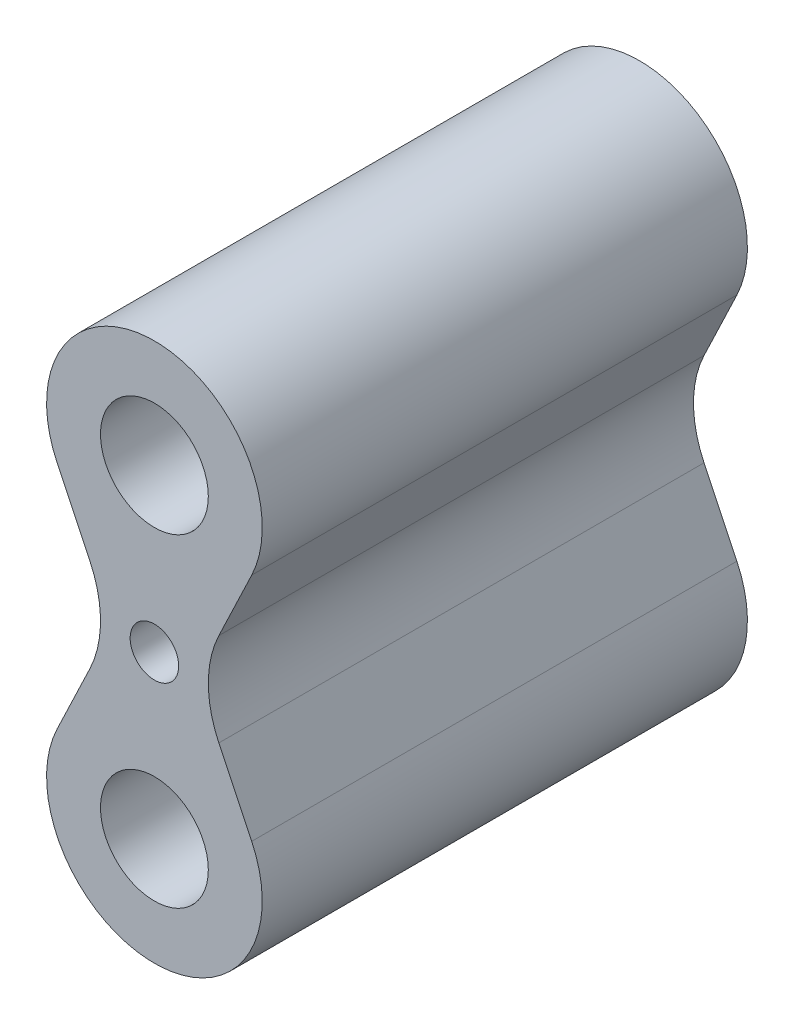
ISO-10303-21;
HEADER;
FILE_DESCRIPTION(('STEP AP214'),'2;1');
FILE_NAME('part.step','',(''),(''),'','','');
FILE_SCHEMA(('AUTOMOTIVE_DESIGN { 1 0 10303 214 1 1 1 1 }'));
ENDSEC;
DATA;
#1=APPLICATION_CONTEXT('core data for automotive mechanical design processes');
#2=APPLICATION_PROTOCOL_DEFINITION('international standard','automotive_design',2000,#1);
#3=PRODUCT_CONTEXT('',#1,'mechanical');
#4=PRODUCT('Part','Part','',(#3));
#5=PRODUCT_RELATED_PRODUCT_CATEGORY('part','',(#4));
#6=PRODUCT_DEFINITION_FORMATION('','',#4);
#7=PRODUCT_DEFINITION_CONTEXT('part definition',#1,'design');
#8=PRODUCT_DEFINITION('design','',#6,#7);
#9=PRODUCT_DEFINITION_SHAPE('','',#8);
#10=(LENGTH_UNIT() NAMED_UNIT(*) SI_UNIT(.MILLI.,.METRE.));
#11=(NAMED_UNIT(*) PLANE_ANGLE_UNIT() SI_UNIT($,.RADIAN.));
#12=(NAMED_UNIT(*) SI_UNIT($,.STERADIAN.) SOLID_ANGLE_UNIT());
#13=UNCERTAINTY_MEASURE_WITH_UNIT(LENGTH_MEASURE(1.E-05),#10,'distance_accuracy_value','');
#14=(GEOMETRIC_REPRESENTATION_CONTEXT(3) GLOBAL_UNCERTAINTY_ASSIGNED_CONTEXT((#13)) GLOBAL_UNIT_ASSIGNED_CONTEXT((#10,
#11,#12)) REPRESENTATION_CONTEXT('',''));
#15=CARTESIAN_POINT('',(0.,0.,0.));
#16=DIRECTION('',(0.,0.,1.));
#17=DIRECTION('',(1.,0.,0.));
#18=AXIS2_PLACEMENT_3D('',#15,#16,#17);
#19=CARTESIAN_POINT('',(0.,30.,45.));
#20=DIRECTION('',(0.,0.,1.));
#21=DIRECTION('',(1.,0.,0.));
#22=AXIS2_PLACEMENT_3D('',#19,#20,#21);
#23=PLANE('',#22);
#24=CARTESIAN_POINT('',(0.,0.,45.));
#25=DIRECTION('',(0.,0.,1.));
#26=DIRECTION('',(1.,0.,0.));
#27=AXIS2_PLACEMENT_3D('',#24,#25,#26);
#28=CIRCLE('',#27,4.49999999999999);
#29=CARTESIAN_POINT('',(4.49999999999999,0.,45.));
#30=VERTEX_POINT('',#29);
#31=EDGE_CURVE('E195',#30,#30,#28,.T.);
#32=ORIENTED_EDGE('',*,*,#31,.F.);
#33=EDGE_LOOP('',(#32));
#34=FACE_BOUND('',#33,.T.);
#35=CARTESIAN_POINT('',(0.,30.,45.));
#36=DIRECTION('',(0.,0.,1.));
#37=DIRECTION('',(1.,0.,0.));
#38=AXIS2_PLACEMENT_3D('',#35,#36,#37);
#39=CIRCLE('',#38,10.);
#40=CARTESIAN_POINT('',(10.,30.,45.));
#41=VERTEX_POINT('',#40);
#42=EDGE_CURVE('E136',#41,#41,#39,.T.);
#43=ORIENTED_EDGE('',*,*,#42,.F.);
#44=EDGE_LOOP('',(#43));
#45=FACE_BOUND('',#44,.T.);
#46=CARTESIAN_POINT('',(0.,30.,45.));
#47=DIRECTION('',(0.,0.,1.));
#48=DIRECTION('',(1.,0.,0.));
#49=AXIS2_PLACEMENT_3D('',#46,#47,#48);
#50=CIRCLE('',#49,20.);
#51=CARTESIAN_POINT('',(18.0473785412436,21.380711874577,45.));
#52=VERTEX_POINT('',#51);
#53=CARTESIAN_POINT('',(-18.0473785412436,21.380711874577,45.));
#54=VERTEX_POINT('',#53);
#55=EDGE_CURVE('E147',#52,#54,#50,.T.);
#56=ORIENTED_EDGE('',*,*,#55,.T.);
#57=DIRECTION('',(0.430964406271149,-0.902368927062183,0.));
#58=VECTOR('',#57,1.);
#59=CARTESIAN_POINT('',(-18.0473785412436,21.380711874577,45.));
#60=LINE('',#59,#58);
#61=CARTESIAN_POINT('',(-11.9526214587564,8.61928812542301,45.));
#62=VERTEX_POINT('',#61);
#63=EDGE_CURVE('E95',#54,#62,#60,.T.);
#64=ORIENTED_EDGE('',*,*,#63,.T.);
#65=CARTESIAN_POINT('',(-30.,0.,45.));
#66=DIRECTION('',(0.,0.,-1.));
#67=DIRECTION('',(1.,0.,0.));
#68=AXIS2_PLACEMENT_3D('',#65,#66,#67);
#69=CIRCLE('',#68,20.);
#70=CARTESIAN_POINT('',(-11.9526214587564,-8.61928812542302,45.));
#71=VERTEX_POINT('',#70);
#72=EDGE_CURVE('E162',#62,#71,#69,.T.);
#73=ORIENTED_EDGE('',*,*,#72,.T.);
#74=DIRECTION('',(-0.430964406271151,-0.902368927062183,0.));
#75=VECTOR('',#74,1.);
#76=CARTESIAN_POINT('',(-11.9526214587563,-8.61928812542302,45.));
#77=LINE('',#76,#75);
#78=CARTESIAN_POINT('',(-18.0473785412436,-21.380711874577,45.));
#79=VERTEX_POINT('',#78);
#80=EDGE_CURVE('E175',#71,#79,#77,.T.);
#81=ORIENTED_EDGE('',*,*,#80,.T.);
#82=CARTESIAN_POINT('',(0.,-30.,45.));
#83=DIRECTION('',(0.,0.,1.));
#84=DIRECTION('',(1.,0.,0.));
#85=AXIS2_PLACEMENT_3D('',#82,#83,#84);
#86=CIRCLE('',#85,20.);
#87=CARTESIAN_POINT('',(18.0473785412436,-21.380711874577,45.));
#88=VERTEX_POINT('',#87);
#89=EDGE_CURVE('E114',#79,#88,#86,.T.);
#90=ORIENTED_EDGE('',*,*,#89,.T.);
#91=DIRECTION('',(-0.430964406271151,0.902368927062182,0.));
#92=VECTOR('',#91,1.);
#93=CARTESIAN_POINT('',(11.9526214587563,-8.61928812542302,45.));
#94=LINE('',#93,#92);
#95=CARTESIAN_POINT('',(11.9526214587563,-8.61928812542302,45.));
#96=VERTEX_POINT('',#95);
#97=EDGE_CURVE('E108',#88,#96,#94,.T.);
#98=ORIENTED_EDGE('',*,*,#97,.T.);
#99=CARTESIAN_POINT('',(30.,0.,45.));
#100=DIRECTION('',(0.,0.,-1.));
#101=DIRECTION('',(1.,0.,0.));
#102=AXIS2_PLACEMENT_3D('',#99,#100,#101);
#103=CIRCLE('',#102,20.);
#104=CARTESIAN_POINT('',(11.9526214587563,8.61928812542301,45.));
#105=VERTEX_POINT('',#104);
#106=EDGE_CURVE('E112',#96,#105,#103,.T.);
#107=ORIENTED_EDGE('',*,*,#106,.T.);
#108=DIRECTION('',(0.430964406271151,0.902368927062183,0.));
#109=VECTOR('',#108,1.);
#110=CARTESIAN_POINT('',(18.0473785412436,21.380711874577,45.));
#111=LINE('',#110,#109);
#112=EDGE_CURVE('E52',#105,#52,#111,.T.);
#113=ORIENTED_EDGE('',*,*,#112,.T.);
#114=EDGE_LOOP('',(#56,#64,#73,#81,#90,#98,#107,#113));
#115=FACE_BOUND('',#114,.T.);
#116=CARTESIAN_POINT('',(0.,-30.,45.));
#117=DIRECTION('',(0.,0.,1.));
#118=DIRECTION('',(1.,0.,0.));
#119=AXIS2_PLACEMENT_3D('',#116,#117,#118);
#120=CIRCLE('',#119,10.);
#121=CARTESIAN_POINT('',(10.,-30.,45.));
#122=VERTEX_POINT('',#121);
#123=EDGE_CURVE('E184',#122,#122,#120,.T.);
#124=ORIENTED_EDGE('',*,*,#123,.F.);
#125=EDGE_LOOP('',(#124));
#126=FACE_BOUND('',#125,.T.);
#127=ADVANCED_FACE('F35',(#34,#45,#115,#126),#23,.T.);
#128=CARTESIAN_POINT('',(0.,30.,-45.));
#129=DIRECTION('',(0.,0.,1.));
#130=DIRECTION('',(1.,0.,0.));
#131=AXIS2_PLACEMENT_3D('',#128,#129,#130);
#132=PLANE('',#131);
#133=CARTESIAN_POINT('',(0.,0.,-45.));
#134=DIRECTION('',(0.,0.,1.));
#135=DIRECTION('',(1.,0.,0.));
#136=AXIS2_PLACEMENT_3D('',#133,#134,#135);
#137=CIRCLE('',#136,4.49999999999998);
#138=CARTESIAN_POINT('',(4.49999999999998,0.,-45.));
#139=VERTEX_POINT('',#138);
#140=EDGE_CURVE('E190',#139,#139,#137,.T.);
#141=ORIENTED_EDGE('',*,*,#140,.T.);
#142=EDGE_LOOP('',(#141));
#143=FACE_BOUND('',#142,.T.);
#144=CARTESIAN_POINT('',(0.,30.,-45.));
#145=DIRECTION('',(0.,0.,1.));
#146=DIRECTION('',(1.,0.,0.));
#147=AXIS2_PLACEMENT_3D('',#144,#145,#146);
#148=CIRCLE('',#147,20.);
#149=CARTESIAN_POINT('',(18.0473785412436,21.380711874577,-45.));
#150=VERTEX_POINT('',#149);
#151=CARTESIAN_POINT('',(-18.0473785412436,21.380711874577,-45.));
#152=VERTEX_POINT('',#151);
#153=EDGE_CURVE('E132',#150,#152,#148,.T.);
#154=ORIENTED_EDGE('',*,*,#153,.F.);
#155=DIRECTION('',(0.430964406271151,0.902368927062183,0.));
#156=VECTOR('',#155,1.);
#157=CARTESIAN_POINT('',(18.0473785412436,21.380711874577,-45.));
#158=LINE('',#157,#156);
#159=CARTESIAN_POINT('',(11.9526214587563,8.61928812542301,-45.));
#160=VERTEX_POINT('',#159);
#161=EDGE_CURVE('E87',#160,#150,#158,.T.);
#162=ORIENTED_EDGE('',*,*,#161,.F.);
#163=CARTESIAN_POINT('',(30.,0.,-45.));
#164=DIRECTION('',(0.,0.,-1.));
#165=DIRECTION('',(1.,0.,0.));
#166=AXIS2_PLACEMENT_3D('',#163,#164,#165);
#167=CIRCLE('',#166,20.);
#168=CARTESIAN_POINT('',(11.9526214587563,-8.61928812542302,-45.));
#169=VERTEX_POINT('',#168);
#170=EDGE_CURVE('E81',#169,#160,#167,.T.);
#171=ORIENTED_EDGE('',*,*,#170,.F.);
#172=DIRECTION('',(-0.430964406271151,0.902368927062182,0.));
#173=VECTOR('',#172,1.);
#174=CARTESIAN_POINT('',(11.9526214587563,-8.61928812542302,-45.));
#175=LINE('',#174,#173);
#176=CARTESIAN_POINT('',(18.0473785412436,-21.380711874577,-45.));
#177=VERTEX_POINT('',#176);
#178=EDGE_CURVE('E122',#177,#169,#175,.T.);
#179=ORIENTED_EDGE('',*,*,#178,.F.);
#180=CARTESIAN_POINT('',(0.,-30.,-45.));
#181=DIRECTION('',(0.,0.,1.));
#182=DIRECTION('',(1.,0.,0.));
#183=AXIS2_PLACEMENT_3D('',#180,#181,#182);
#184=CIRCLE('',#183,20.);
#185=CARTESIAN_POINT('',(-18.0473785412436,-21.380711874577,-45.));
#186=VERTEX_POINT('',#185);
#187=EDGE_CURVE('E142',#186,#177,#184,.T.);
#188=ORIENTED_EDGE('',*,*,#187,.F.);
#189=DIRECTION('',(-0.430964406271151,-0.902368927062183,0.));
#190=VECTOR('',#189,1.);
#191=CARTESIAN_POINT('',(-11.9526214587563,-8.61928812542302,-45.));
#192=LINE('',#191,#190);
#193=CARTESIAN_POINT('',(-11.9526214587564,-8.61928812542302,-45.));
#194=VERTEX_POINT('',#193);
#195=EDGE_CURVE('E140',#194,#186,#192,.T.);
#196=ORIENTED_EDGE('',*,*,#195,.F.);
#197=CARTESIAN_POINT('',(-30.,0.,-45.));
#198=DIRECTION('',(0.,0.,-1.));
#199=DIRECTION('',(1.,0.,0.));
#200=AXIS2_PLACEMENT_3D('',#197,#198,#199);
#201=CIRCLE('',#200,20.);
#202=CARTESIAN_POINT('',(-11.9526214587564,8.61928812542301,-45.));
#203=VERTEX_POINT('',#202);
#204=EDGE_CURVE('E138',#203,#194,#201,.T.);
#205=ORIENTED_EDGE('',*,*,#204,.F.);
#206=DIRECTION('',(0.430964406271149,-0.902368927062183,0.));
#207=VECTOR('',#206,1.);
#208=CARTESIAN_POINT('',(-18.0473785412436,21.380711874577,-45.));
#209=LINE('',#208,#207);
#210=EDGE_CURVE('E135',#152,#203,#209,.T.);
#211=ORIENTED_EDGE('',*,*,#210,.F.);
#212=EDGE_LOOP('',(#154,#162,#171,#179,#188,#196,#205,#211));
#213=FACE_BOUND('',#212,.T.);
#214=CARTESIAN_POINT('',(0.,30.,-45.));
#215=DIRECTION('',(0.,0.,1.));
#216=DIRECTION('',(1.,0.,0.));
#217=AXIS2_PLACEMENT_3D('',#214,#215,#216);
#218=CIRCLE('',#217,10.);
#219=CARTESIAN_POINT('',(10.,30.,-45.));
#220=VERTEX_POINT('',#219);
#221=EDGE_CURVE('E181',#220,#220,#218,.T.);
#222=ORIENTED_EDGE('',*,*,#221,.T.);
#223=EDGE_LOOP('',(#222));
#224=FACE_BOUND('',#223,.T.);
#225=CARTESIAN_POINT('',(0.,-30.,-45.));
#226=DIRECTION('',(0.,0.,1.));
#227=DIRECTION('',(1.,0.,0.));
#228=AXIS2_PLACEMENT_3D('',#225,#226,#227);
#229=CIRCLE('',#228,10.);
#230=CARTESIAN_POINT('',(10.,-30.,-45.));
#231=VERTEX_POINT('',#230);
#232=EDGE_CURVE('E187',#231,#231,#229,.T.);
#233=ORIENTED_EDGE('',*,*,#232,.T.);
#234=EDGE_LOOP('',(#233));
#235=FACE_BOUND('',#234,.T.);
#236=ADVANCED_FACE('F166',(#143,#213,#224,#235),#132,.F.);
#237=CARTESIAN_POINT('',(0.,30.,45.));
#238=DIRECTION('',(0.,0.,-1.));
#239=DIRECTION('',(-1.,0.,0.));
#240=AXIS2_PLACEMENT_3D('',#237,#238,#239);
#241=CYLINDRICAL_SURFACE('',#240,20.);
#242=ORIENTED_EDGE('',*,*,#153,.T.);
#243=DIRECTION('',(0.,0.,-1.));
#244=VECTOR('',#243,1.);
#245=CARTESIAN_POINT('',(-18.0473785412436,21.380711874577,45.));
#246=LINE('',#245,#244);
#247=EDGE_CURVE('E11',#54,#152,#246,.T.);
#248=ORIENTED_EDGE('',*,*,#247,.F.);
#249=ORIENTED_EDGE('',*,*,#55,.F.);
#250=DIRECTION('',(0.,0.,-1.));
#251=VECTOR('',#250,1.);
#252=CARTESIAN_POINT('',(18.0473785412436,21.380711874577,45.));
#253=LINE('',#252,#251);
#254=EDGE_CURVE('E128',#52,#150,#253,.T.);
#255=ORIENTED_EDGE('',*,*,#254,.T.);
#256=EDGE_LOOP('',(#242,#248,#249,#255));
#257=FACE_BOUND('',#256,.T.);
#258=ADVANCED_FACE('F37',(#257),#241,.T.);
#259=CARTESIAN_POINT('',(-18.0473785412436,21.380711874577,45.));
#260=DIRECTION('',(0.902368927062183,0.430964406271149,0.));
#261=DIRECTION('',(-0.430964406271149,0.902368927062183,0.));
#262=AXIS2_PLACEMENT_3D('',#259,#260,#261);
#263=PLANE('',#262);
#264=ORIENTED_EDGE('',*,*,#210,.T.);
#265=DIRECTION('',(0.,0.,-1.));
#266=VECTOR('',#265,1.);
#267=CARTESIAN_POINT('',(-11.9526214587564,8.61928812542301,45.));
#268=LINE('',#267,#266);
#269=EDGE_CURVE('E44',#62,#203,#268,.T.);
#270=ORIENTED_EDGE('',*,*,#269,.F.);
#271=ORIENTED_EDGE('',*,*,#63,.F.);
#272=ORIENTED_EDGE('',*,*,#247,.T.);
#273=EDGE_LOOP('',(#264,#270,#271,#272));
#274=FACE_BOUND('',#273,.T.);
#275=ADVANCED_FACE('F239',(#274),#263,.F.);
#276=CARTESIAN_POINT('',(-30.,0.,45.));
#277=DIRECTION('',(0.,0.,-1.));
#278=DIRECTION('',(-1.,0.,0.));
#279=AXIS2_PLACEMENT_3D('',#276,#277,#278);
#280=CYLINDRICAL_SURFACE('',#279,20.);
#281=ORIENTED_EDGE('',*,*,#204,.T.);
#282=DIRECTION('',(0.,0.,-1.));
#283=VECTOR('',#282,1.);
#284=CARTESIAN_POINT('',(-11.9526214587564,-8.61928812542302,45.));
#285=LINE('',#284,#283);
#286=EDGE_CURVE('E154',#71,#194,#285,.T.);
#287=ORIENTED_EDGE('',*,*,#286,.F.);
#288=ORIENTED_EDGE('',*,*,#72,.F.);
#289=ORIENTED_EDGE('',*,*,#269,.T.);
#290=EDGE_LOOP('',(#281,#287,#288,#289));
#291=FACE_BOUND('',#290,.T.);
#292=ADVANCED_FACE('F160',(#291),#280,.F.);
#293=CARTESIAN_POINT('',(-11.9526214587563,-8.61928812542302,45.));
#294=DIRECTION('',(0.902368927062183,-0.430964406271151,0.));
#295=DIRECTION('',(0.430964406271151,0.902368927062183,0.));
#296=AXIS2_PLACEMENT_3D('',#293,#294,#295);
#297=PLANE('',#296);
#298=ORIENTED_EDGE('',*,*,#195,.T.);
#299=DIRECTION('',(0.,0.,-1.));
#300=VECTOR('',#299,1.);
#301=CARTESIAN_POINT('',(-18.0473785412436,-21.380711874577,45.));
#302=LINE('',#301,#300);
#303=EDGE_CURVE('E151',#79,#186,#302,.T.);
#304=ORIENTED_EDGE('',*,*,#303,.F.);
#305=ORIENTED_EDGE('',*,*,#80,.F.);
#306=ORIENTED_EDGE('',*,*,#286,.T.);
#307=EDGE_LOOP('',(#298,#304,#305,#306));
#308=FACE_BOUND('',#307,.T.);
#309=ADVANCED_FACE('F171',(#308),#297,.F.);
#310=CARTESIAN_POINT('',(0.,-30.,45.));
#311=DIRECTION('',(0.,0.,-1.));
#312=DIRECTION('',(-1.,0.,0.));
#313=AXIS2_PLACEMENT_3D('',#310,#311,#312);
#314=CYLINDRICAL_SURFACE('',#313,20.);
#315=ORIENTED_EDGE('',*,*,#187,.T.);
#316=DIRECTION('',(0.,0.,-1.));
#317=VECTOR('',#316,1.);
#318=CARTESIAN_POINT('',(18.0473785412436,-21.380711874577,45.));
#319=LINE('',#318,#317);
#320=EDGE_CURVE('E123',#88,#177,#319,.T.);
#321=ORIENTED_EDGE('',*,*,#320,.F.);
#322=ORIENTED_EDGE('',*,*,#89,.F.);
#323=ORIENTED_EDGE('',*,*,#303,.T.);
#324=EDGE_LOOP('',(#315,#321,#322,#323));
#325=FACE_BOUND('',#324,.T.);
#326=ADVANCED_FACE('F174',(#325),#314,.T.);
#327=CARTESIAN_POINT('',(11.9526214587563,-8.61928812542302,45.));
#328=DIRECTION('',(-0.902368927062182,-0.430964406271151,0.));
#329=DIRECTION('',(0.430964406271151,-0.902368927062182,0.));
#330=AXIS2_PLACEMENT_3D('',#327,#328,#329);
#331=PLANE('',#330);
#332=ORIENTED_EDGE('',*,*,#178,.T.);
#333=DIRECTION('',(0.,0.,-1.));
#334=VECTOR('',#333,1.);
#335=CARTESIAN_POINT('',(11.9526214587563,-8.61928812542302,45.));
#336=LINE('',#335,#334);
#337=EDGE_CURVE('E119',#96,#169,#336,.T.);
#338=ORIENTED_EDGE('',*,*,#337,.F.);
#339=ORIENTED_EDGE('',*,*,#97,.F.);
#340=ORIENTED_EDGE('',*,*,#320,.T.);
#341=EDGE_LOOP('',(#332,#338,#339,#340));
#342=FACE_BOUND('',#341,.T.);
#343=ADVANCED_FACE('F120',(#342),#331,.F.);
#344=CARTESIAN_POINT('',(30.,0.,45.));
#345=DIRECTION('',(0.,0.,-1.));
#346=DIRECTION('',(-1.,0.,0.));
#347=AXIS2_PLACEMENT_3D('',#344,#345,#346);
#348=CYLINDRICAL_SURFACE('',#347,20.);
#349=ORIENTED_EDGE('',*,*,#170,.T.);
#350=DIRECTION('',(0.,0.,-1.));
#351=VECTOR('',#350,1.);
#352=CARTESIAN_POINT('',(11.9526214587563,8.61928812542301,45.));
#353=LINE('',#352,#351);
#354=EDGE_CURVE('E124',#105,#160,#353,.T.);
#355=ORIENTED_EDGE('',*,*,#354,.F.);
#356=ORIENTED_EDGE('',*,*,#106,.F.);
#357=ORIENTED_EDGE('',*,*,#337,.T.);
#358=EDGE_LOOP('',(#349,#355,#356,#357));
#359=FACE_BOUND('',#358,.T.);
#360=ADVANCED_FACE('F126',(#359),#348,.F.);
#361=CARTESIAN_POINT('',(18.0473785412436,21.380711874577,45.));
#362=DIRECTION('',(-0.902368927062183,0.430964406271151,0.));
#363=DIRECTION('',(-0.430964406271151,-0.902368927062183,0.));
#364=AXIS2_PLACEMENT_3D('',#361,#362,#363);
#365=PLANE('',#364);
#366=ORIENTED_EDGE('',*,*,#161,.T.);
#367=ORIENTED_EDGE('',*,*,#254,.F.);
#368=ORIENTED_EDGE('',*,*,#112,.F.);
#369=ORIENTED_EDGE('',*,*,#354,.T.);
#370=EDGE_LOOP('',(#366,#367,#368,#369));
#371=FACE_BOUND('',#370,.T.);
#372=ADVANCED_FACE('F210',(#371),#365,.F.);
#373=CARTESIAN_POINT('',(0.,30.,45.));
#374=DIRECTION('',(0.,0.,-1.));
#375=DIRECTION('',(-1.,0.,0.));
#376=AXIS2_PLACEMENT_3D('',#373,#374,#375);
#377=CYLINDRICAL_SURFACE('',#376,10.);
#378=ORIENTED_EDGE('',*,*,#42,.T.);
#379=EDGE_LOOP('',(#378));
#380=FACE_BOUND('',#379,.T.);
#381=ORIENTED_EDGE('',*,*,#221,.F.);
#382=EDGE_LOOP('',(#381));
#383=FACE_BOUND('',#382,.T.);
#384=ADVANCED_FACE('F206',(#380,#383),#377,.F.);
#385=CARTESIAN_POINT('',(0.,-30.,45.));
#386=DIRECTION('',(0.,0.,-1.));
#387=DIRECTION('',(-1.,0.,0.));
#388=AXIS2_PLACEMENT_3D('',#385,#386,#387);
#389=CYLINDRICAL_SURFACE('',#388,10.);
#390=ORIENTED_EDGE('',*,*,#123,.T.);
#391=EDGE_LOOP('',(#390));
#392=FACE_BOUND('',#391,.T.);
#393=ORIENTED_EDGE('',*,*,#232,.F.);
#394=EDGE_LOOP('',(#393));
#395=FACE_BOUND('',#394,.T.);
#396=ADVANCED_FACE('F209',(#392,#395),#389,.F.);
#397=CARTESIAN_POINT('',(0.,0.,45.));
#398=DIRECTION('',(0.,0.,1.));
#399=DIRECTION('',(1.,0.,0.));
#400=AXIS2_PLACEMENT_3D('',#397,#398,#399);
#401=CYLINDRICAL_SURFACE('',#400,4.49999999999998);
#402=ORIENTED_EDGE('',*,*,#140,.F.);
#403=EDGE_LOOP('',(#402));
#404=FACE_BOUND('',#403,.T.);
#405=ORIENTED_EDGE('',*,*,#31,.T.);
#406=EDGE_LOOP('',(#405));
#407=FACE_BOUND('',#406,.T.);
#408=ADVANCED_FACE('F199',(#404,#407),#401,.F.);
#409=CLOSED_SHELL('',(#127,#236,#258,#275,#292,#309,#326,#343,#360,#372,#384,#396,#408));
#410=MANIFOLD_SOLID_BREP('B2',#409);
#411=ADVANCED_BREP_SHAPE_REPRESENTATION('',(#18,#410),#14);
#412=SHAPE_DEFINITION_REPRESENTATION(#9,#411);
ENDSEC;
END-ISO-10303-21;
